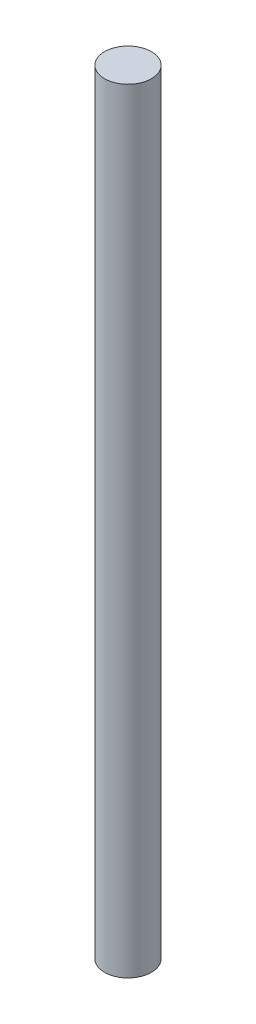
ISO-10303-21;
HEADER;
FILE_DESCRIPTION(('STEP AP214'),'2;1');
FILE_NAME('part.step','',(''),(''),'','','');
FILE_SCHEMA(('AUTOMOTIVE_DESIGN { 1 0 10303 214 1 1 1 1 }'));
ENDSEC;
DATA;
#1=APPLICATION_CONTEXT('core data for automotive mechanical design processes');
#2=APPLICATION_PROTOCOL_DEFINITION('international standard','automotive_design',2000,#1);
#3=PRODUCT_CONTEXT('',#1,'mechanical');
#4=PRODUCT('Part','Part','',(#3));
#5=PRODUCT_RELATED_PRODUCT_CATEGORY('part','',(#4));
#6=PRODUCT_DEFINITION_FORMATION('','',#4);
#7=PRODUCT_DEFINITION_CONTEXT('part definition',#1,'design');
#8=PRODUCT_DEFINITION('design','',#6,#7);
#9=PRODUCT_DEFINITION_SHAPE('','',#8);
#10=(LENGTH_UNIT() NAMED_UNIT(*) SI_UNIT(.MILLI.,.METRE.));
#11=(NAMED_UNIT(*) PLANE_ANGLE_UNIT() SI_UNIT($,.RADIAN.));
#12=(NAMED_UNIT(*) SI_UNIT($,.STERADIAN.) SOLID_ANGLE_UNIT());
#13=UNCERTAINTY_MEASURE_WITH_UNIT(LENGTH_MEASURE(1.E-05),#10,'distance_accuracy_value','');
#14=(GEOMETRIC_REPRESENTATION_CONTEXT(3) GLOBAL_UNCERTAINTY_ASSIGNED_CONTEXT((#13)) GLOBAL_UNIT_ASSIGNED_CONTEXT((#10,
#11,#12)) REPRESENTATION_CONTEXT('',''));
#15=CARTESIAN_POINT('',(0.,0.,0.));
#16=DIRECTION('',(0.,0.,1.));
#17=DIRECTION('',(1.,0.,0.));
#18=AXIS2_PLACEMENT_3D('',#15,#16,#17);
#19=CARTESIAN_POINT('',(0.,104.,0.));
#20=DIRECTION('',(0.,-1.,0.));
#21=DIRECTION('',(0.,0.,-1.));
#22=AXIS2_PLACEMENT_3D('',#19,#20,#21);
#23=CYLINDRICAL_SURFACE('',#22,3.15);
#24=CARTESIAN_POINT('',(0.,104.,0.));
#25=DIRECTION('',(0.,1.,0.));
#26=DIRECTION('',(0.,0.,1.));
#27=AXIS2_PLACEMENT_3D('',#24,#25,#26);
#28=CIRCLE('',#27,3.15);
#29=CARTESIAN_POINT('',(0.,104.,3.15));
#30=VERTEX_POINT('',#29);
#31=EDGE_CURVE('E10',#30,#30,#28,.T.);
#32=ORIENTED_EDGE('',*,*,#31,.F.);
#33=EDGE_LOOP('',(#32));
#34=FACE_BOUND('',#33,.T.);
#35=CARTESIAN_POINT('',(0.,0.,0.));
#36=DIRECTION('',(0.,1.,0.));
#37=DIRECTION('',(0.,0.,1.));
#38=AXIS2_PLACEMENT_3D('',#35,#36,#37);
#39=CIRCLE('',#38,3.15);
#40=CARTESIAN_POINT('',(0.,0.,3.15));
#41=VERTEX_POINT('',#40);
#42=EDGE_CURVE('E34',#41,#41,#39,.T.);
#43=ORIENTED_EDGE('',*,*,#42,.T.);
#44=EDGE_LOOP('',(#43));
#45=FACE_BOUND('',#44,.T.);
#46=ADVANCED_FACE('F31',(#34,#45),#23,.T.);
#47=CARTESIAN_POINT('',(0.,104.,0.));
#48=DIRECTION('',(0.,1.,0.));
#49=DIRECTION('',(0.,0.,1.));
#50=AXIS2_PLACEMENT_3D('',#47,#48,#49);
#51=PLANE('',#50);
#52=ORIENTED_EDGE('',*,*,#31,.T.);
#53=EDGE_LOOP('',(#52));
#54=FACE_BOUND('',#53,.T.);
#55=ADVANCED_FACE('F46',(#54),#51,.T.);
#56=CARTESIAN_POINT('',(0.,0.,0.));
#57=DIRECTION('',(0.,1.,0.));
#58=DIRECTION('',(0.,0.,1.));
#59=AXIS2_PLACEMENT_3D('',#56,#57,#58);
#60=PLANE('',#59);
#61=ORIENTED_EDGE('',*,*,#42,.F.);
#62=EDGE_LOOP('',(#61));
#63=FACE_BOUND('',#62,.T.);
#64=ADVANCED_FACE('F44',(#63),#60,.F.);
#65=CLOSED_SHELL('',(#46,#55,#64));
#66=MANIFOLD_SOLID_BREP('B2',#65);
#67=ADVANCED_BREP_SHAPE_REPRESENTATION('',(#18,#66),#14);
#68=SHAPE_DEFINITION_REPRESENTATION(#9,#67);
ENDSEC;
END-ISO-10303-21;
